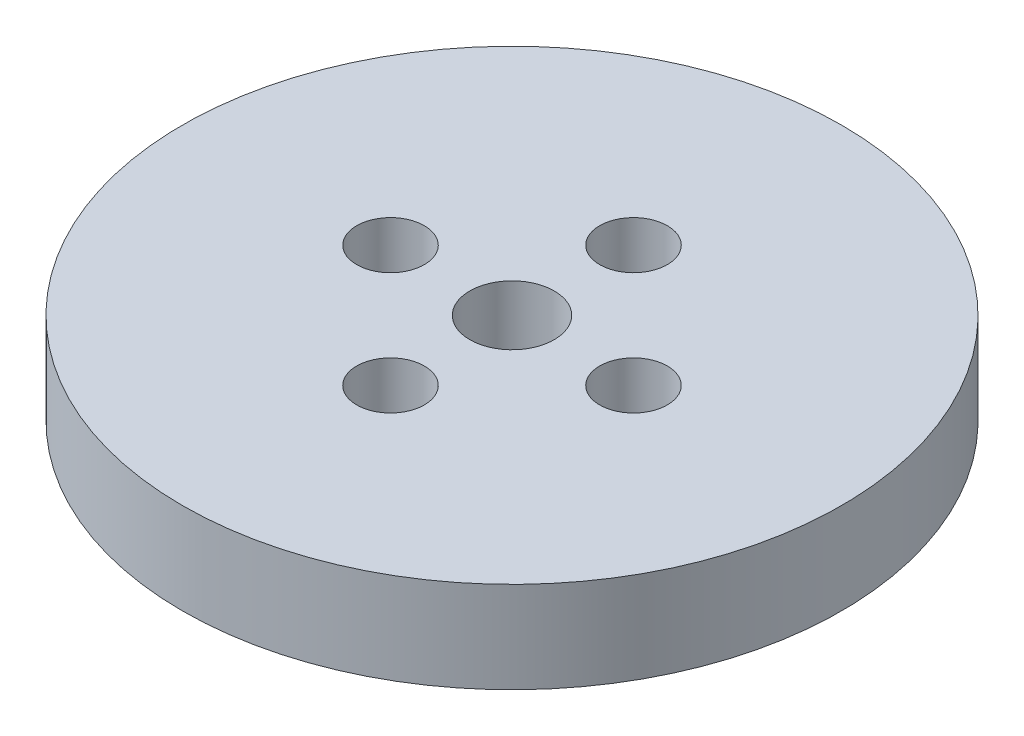
ISO-10303-21;
HEADER;
FILE_DESCRIPTION(('STEP AP214'),'2;1');
FILE_NAME('part.step','',(''),(''),'','','');
FILE_SCHEMA(('AUTOMOTIVE_DESIGN { 1 0 10303 214 1 1 1 1 }'));
ENDSEC;
DATA;
#1=APPLICATION_CONTEXT('core data for automotive mechanical design processes');
#2=APPLICATION_PROTOCOL_DEFINITION('international standard','automotive_design',2000,#1);
#3=PRODUCT_CONTEXT('',#1,'mechanical');
#4=PRODUCT('Part','Part','',(#3));
#5=PRODUCT_RELATED_PRODUCT_CATEGORY('part','',(#4));
#6=PRODUCT_DEFINITION_FORMATION('','',#4);
#7=PRODUCT_DEFINITION_CONTEXT('part definition',#1,'design');
#8=PRODUCT_DEFINITION('design','',#6,#7);
#9=PRODUCT_DEFINITION_SHAPE('','',#8);
#10=(LENGTH_UNIT() NAMED_UNIT(*) SI_UNIT(.MILLI.,.METRE.));
#11=(NAMED_UNIT(*) PLANE_ANGLE_UNIT() SI_UNIT($,.RADIAN.));
#12=(NAMED_UNIT(*) SI_UNIT($,.STERADIAN.) SOLID_ANGLE_UNIT());
#13=UNCERTAINTY_MEASURE_WITH_UNIT(LENGTH_MEASURE(1.E-05),#10,'distance_accuracy_value','');
#14=(GEOMETRIC_REPRESENTATION_CONTEXT(3) GLOBAL_UNCERTAINTY_ASSIGNED_CONTEXT((#13)) GLOBAL_UNIT_ASSIGNED_CONTEXT((#10,
#11,#12)) REPRESENTATION_CONTEXT('',''));
#15=CARTESIAN_POINT('',(0.,0.,0.));
#16=DIRECTION('',(0.,0.,1.));
#17=DIRECTION('',(1.,0.,0.));
#18=AXIS2_PLACEMENT_3D('',#15,#16,#17);
#19=CARTESIAN_POINT('',(0.,27.,0.));
#20=DIRECTION('',(0.,-1.,0.));
#21=DIRECTION('',(0.,0.,-1.));
#22=AXIS2_PLACEMENT_3D('',#19,#20,#21);
#23=CYLINDRICAL_SURFACE('',#22,97.5);
#24=CARTESIAN_POINT('',(0.,27.,0.));
#25=DIRECTION('',(0.,1.,0.));
#26=DIRECTION('',(0.,0.,1.));
#27=AXIS2_PLACEMENT_3D('',#24,#25,#26);
#28=CIRCLE('',#27,97.5);
#29=CARTESIAN_POINT('',(0.,27.,97.5));
#30=VERTEX_POINT('',#29);
#31=EDGE_CURVE('E10',#30,#30,#28,.T.);
#32=ORIENTED_EDGE('',*,*,#31,.F.);
#33=EDGE_LOOP('',(#32));
#34=FACE_BOUND('',#33,.T.);
#35=CARTESIAN_POINT('',(0.,0.,0.));
#36=DIRECTION('',(0.,1.,0.));
#37=DIRECTION('',(0.,0.,1.));
#38=AXIS2_PLACEMENT_3D('',#35,#36,#37);
#39=CIRCLE('',#38,97.5);
#40=CARTESIAN_POINT('',(0.,0.,97.5));
#41=VERTEX_POINT('',#40);
#42=EDGE_CURVE('E37',#41,#41,#39,.T.);
#43=ORIENTED_EDGE('',*,*,#42,.T.);
#44=EDGE_LOOP('',(#43));
#45=FACE_BOUND('',#44,.T.);
#46=ADVANCED_FACE('F40',(#34,#45),#23,.T.);
#47=CARTESIAN_POINT('',(0.,27.,0.));
#48=DIRECTION('',(0.,1.,0.));
#49=DIRECTION('',(0.,0.,1.));
#50=AXIS2_PLACEMENT_3D('',#47,#48,#49);
#51=PLANE('',#50);
#52=CARTESIAN_POINT('',(1.25500280436656E-13,27.,35.9447089235309));
#53=DIRECTION('',(0.,1.,0.));
#54=DIRECTION('',(1.,0.,0.));
#55=AXIS2_PLACEMENT_3D('',#52,#53,#54);
#56=CIRCLE('',#55,10.);
#57=CARTESIAN_POINT('',(10.0000000000001,27.,35.9447089235308));
#58=VERTEX_POINT('',#57);
#59=EDGE_CURVE('E71',#58,#58,#56,.T.);
#60=ORIENTED_EDGE('',*,*,#59,.F.);
#61=EDGE_LOOP('',(#60));
#62=FACE_BOUND('',#61,.T.);
#63=CARTESIAN_POINT('',(35.9447089235309,27.,0.));
#64=DIRECTION('',(0.,1.,0.));
#65=DIRECTION('',(0.,0.,-1.));
#66=AXIS2_PLACEMENT_3D('',#63,#64,#65);
#67=CIRCLE('',#66,10.);
#68=CARTESIAN_POINT('',(35.9447089235309,27.,-10.));
#69=VERTEX_POINT('',#68);
#70=EDGE_CURVE('E70',#69,#69,#67,.T.);
#71=ORIENTED_EDGE('',*,*,#70,.F.);
#72=EDGE_LOOP('',(#71));
#73=FACE_BOUND('',#72,.T.);
#74=CARTESIAN_POINT('',(-3.76500841309969E-13,27.,-35.9447089235309));
#75=DIRECTION('',(0.,1.,0.));
#76=DIRECTION('',(-1.,0.,0.));
#77=AXIS2_PLACEMENT_3D('',#74,#75,#76);
#78=CIRCLE('',#77,10.);
#79=CARTESIAN_POINT('',(-10.0000000000004,27.,-35.9447089235308));
#80=VERTEX_POINT('',#79);
#81=EDGE_CURVE('E61',#80,#80,#78,.T.);
#82=ORIENTED_EDGE('',*,*,#81,.F.);
#83=EDGE_LOOP('',(#82));
#84=FACE_BOUND('',#83,.T.);
#85=CARTESIAN_POINT('',(-35.9447089235309,27.,0.));
#86=DIRECTION('',(0.,1.,0.));
#87=DIRECTION('',(0.,0.,1.));
#88=AXIS2_PLACEMENT_3D('',#85,#86,#87);
#89=CIRCLE('',#88,10.);
#90=CARTESIAN_POINT('',(-35.9447089235309,27.,10.));
#91=VERTEX_POINT('',#90);
#92=EDGE_CURVE('E54',#91,#91,#89,.T.);
#93=ORIENTED_EDGE('',*,*,#92,.F.);
#94=EDGE_LOOP('',(#93));
#95=FACE_BOUND('',#94,.T.);
#96=CARTESIAN_POINT('',(0.,27.,0.));
#97=DIRECTION('',(0.,1.,0.));
#98=DIRECTION('',(0.,0.,1.));
#99=AXIS2_PLACEMENT_3D('',#96,#97,#98);
#100=CIRCLE('',#99,12.5);
#101=CARTESIAN_POINT('',(0.,27.,12.5));
#102=VERTEX_POINT('',#101);
#103=EDGE_CURVE('E50',#102,#102,#100,.T.);
#104=ORIENTED_EDGE('',*,*,#103,.F.);
#105=EDGE_LOOP('',(#104));
#106=FACE_BOUND('',#105,.T.);
#107=ORIENTED_EDGE('',*,*,#31,.T.);
#108=EDGE_LOOP('',(#107));
#109=FACE_BOUND('',#108,.T.);
#110=ADVANCED_FACE('F86',(#62,#73,#84,#95,#106,#109),#51,.T.);
#111=CARTESIAN_POINT('',(0.,0.,0.));
#112=DIRECTION('',(0.,1.,0.));
#113=DIRECTION('',(0.,0.,1.));
#114=AXIS2_PLACEMENT_3D('',#111,#112,#113);
#115=PLANE('',#114);
#116=CARTESIAN_POINT('',(0.,0.,0.));
#117=DIRECTION('',(0.,1.,0.));
#118=DIRECTION('',(0.,0.,1.));
#119=AXIS2_PLACEMENT_3D('',#116,#117,#118);
#120=CIRCLE('',#119,12.5);
#121=CARTESIAN_POINT('',(0.,0.,12.5));
#122=VERTEX_POINT('',#121);
#123=EDGE_CURVE('E47',#122,#122,#120,.T.);
#124=ORIENTED_EDGE('',*,*,#123,.T.);
#125=EDGE_LOOP('',(#124));
#126=FACE_BOUND('',#125,.T.);
#127=ORIENTED_EDGE('',*,*,#42,.F.);
#128=EDGE_LOOP('',(#127));
#129=FACE_BOUND('',#128,.T.);
#130=ADVANCED_FACE('F93',(#126,#129),#115,.F.);
#131=CARTESIAN_POINT('',(0.,27.,0.));
#132=DIRECTION('',(0.,-1.,0.));
#133=DIRECTION('',(0.,0.,-1.));
#134=AXIS2_PLACEMENT_3D('',#131,#132,#133);
#135=CYLINDRICAL_SURFACE('',#134,12.5);
#136=ORIENTED_EDGE('',*,*,#103,.T.);
#137=EDGE_LOOP('',(#136));
#138=FACE_BOUND('',#137,.T.);
#139=ORIENTED_EDGE('',*,*,#123,.F.);
#140=EDGE_LOOP('',(#139));
#141=FACE_BOUND('',#140,.T.);
#142=ADVANCED_FACE('F101',(#138,#141),#135,.F.);
#143=CARTESIAN_POINT('',(-35.9447089235309,8.21901846282417,0.));
#144=DIRECTION('',(0.,1.,0.));
#145=DIRECTION('',(0.,0.,1.));
#146=AXIS2_PLACEMENT_3D('',#143,#144,#145);
#147=CYLINDRICAL_SURFACE('',#146,10.);
#148=CARTESIAN_POINT('',(-35.9447089235309,8.21901846282417,0.));
#149=DIRECTION('',(0.,1.,0.));
#150=DIRECTION('',(0.,0.,1.));
#151=AXIS2_PLACEMENT_3D('',#148,#149,#150);
#152=CIRCLE('',#151,10.);
#153=CARTESIAN_POINT('',(-35.9447089235309,8.21901846282417,10.));
#154=VERTEX_POINT('',#153);
#155=EDGE_CURVE('E55',#154,#154,#152,.T.);
#156=ORIENTED_EDGE('',*,*,#155,.F.);
#157=EDGE_LOOP('',(#156));
#158=FACE_BOUND('',#157,.T.);
#159=ORIENTED_EDGE('',*,*,#92,.T.);
#160=EDGE_LOOP('',(#159));
#161=FACE_BOUND('',#160,.T.);
#162=ADVANCED_FACE('F102',(#158,#161),#147,.F.);
#163=CARTESIAN_POINT('',(-35.9447089235309,8.21901846282417,0.));
#164=DIRECTION('',(0.,1.,0.));
#165=DIRECTION('',(0.,0.,1.));
#166=AXIS2_PLACEMENT_3D('',#163,#164,#165);
#167=PLANE('',#166);
#168=ORIENTED_EDGE('',*,*,#155,.T.);
#169=EDGE_LOOP('',(#168));
#170=FACE_BOUND('',#169,.T.);
#171=ADVANCED_FACE('F133',(#170),#167,.T.);
#172=CARTESIAN_POINT('',(-3.76500841309969E-13,8.21901846282417,-35.9447089235309));
#173=DIRECTION('',(0.,1.,0.));
#174=DIRECTION('',(0.,0.,1.));
#175=AXIS2_PLACEMENT_3D('',#172,#173,#174);
#176=CYLINDRICAL_SURFACE('',#175,10.);
#177=CARTESIAN_POINT('',(-3.76500841309969E-13,8.21901846282417,-35.9447089235309));
#178=DIRECTION('',(0.,1.,0.));
#179=DIRECTION('',(-1.,0.,0.));
#180=AXIS2_PLACEMENT_3D('',#177,#178,#179);
#181=CIRCLE('',#180,10.);
#182=CARTESIAN_POINT('',(-10.0000000000004,8.21901846282417,-35.9447089235308));
#183=VERTEX_POINT('',#182);
#184=EDGE_CURVE('E63',#183,#183,#181,.T.);
#185=ORIENTED_EDGE('',*,*,#184,.F.);
#186=EDGE_LOOP('',(#185));
#187=FACE_BOUND('',#186,.T.);
#188=ORIENTED_EDGE('',*,*,#81,.T.);
#189=EDGE_LOOP('',(#188));
#190=FACE_BOUND('',#189,.T.);
#191=ADVANCED_FACE('F142',(#187,#190),#176,.F.);
#192=CARTESIAN_POINT('',(-3.76500841309969E-13,8.21901846282417,-35.9447089235309));
#193=DIRECTION('',(0.,1.,0.));
#194=DIRECTION('',(-1.,0.,0.));
#195=AXIS2_PLACEMENT_3D('',#192,#193,#194);
#196=PLANE('',#195);
#197=ORIENTED_EDGE('',*,*,#184,.T.);
#198=EDGE_LOOP('',(#197));
#199=FACE_BOUND('',#198,.T.);
#200=ADVANCED_FACE('F156',(#199),#196,.T.);
#201=CARTESIAN_POINT('',(35.9447089235309,8.21901846282417,0.));
#202=DIRECTION('',(0.,1.,0.));
#203=DIRECTION('',(0.,0.,1.));
#204=AXIS2_PLACEMENT_3D('',#201,#202,#203);
#205=CYLINDRICAL_SURFACE('',#204,10.);
#206=CARTESIAN_POINT('',(35.9447089235309,8.21901846282417,0.));
#207=DIRECTION('',(0.,1.,0.));
#208=DIRECTION('',(0.,0.,-1.));
#209=AXIS2_PLACEMENT_3D('',#206,#207,#208);
#210=CIRCLE('',#209,10.);
#211=CARTESIAN_POINT('',(35.9447089235309,8.21901846282417,-10.));
#212=VERTEX_POINT('',#211);
#213=EDGE_CURVE('E69',#212,#212,#210,.T.);
#214=ORIENTED_EDGE('',*,*,#213,.F.);
#215=EDGE_LOOP('',(#214));
#216=FACE_BOUND('',#215,.T.);
#217=ORIENTED_EDGE('',*,*,#70,.T.);
#218=EDGE_LOOP('',(#217));
#219=FACE_BOUND('',#218,.T.);
#220=ADVANCED_FACE('F164',(#216,#219),#205,.F.);
#221=CARTESIAN_POINT('',(35.9447089235309,8.21901846282417,0.));
#222=DIRECTION('',(0.,1.,0.));
#223=DIRECTION('',(0.,0.,-1.));
#224=AXIS2_PLACEMENT_3D('',#221,#222,#223);
#225=PLANE('',#224);
#226=ORIENTED_EDGE('',*,*,#213,.T.);
#227=EDGE_LOOP('',(#226));
#228=FACE_BOUND('',#227,.T.);
#229=ADVANCED_FACE('F83',(#228),#225,.T.);
#230=CARTESIAN_POINT('',(1.25500280436656E-13,8.21901846282417,35.9447089235309));
#231=DIRECTION('',(0.,1.,0.));
#232=DIRECTION('',(0.,0.,1.));
#233=AXIS2_PLACEMENT_3D('',#230,#231,#232);
#234=CYLINDRICAL_SURFACE('',#233,10.);
#235=CARTESIAN_POINT('',(1.25500280436656E-13,8.21901846282417,35.9447089235309));
#236=DIRECTION('',(0.,1.,0.));
#237=DIRECTION('',(1.,0.,0.));
#238=AXIS2_PLACEMENT_3D('',#235,#236,#237);
#239=CIRCLE('',#238,10.);
#240=CARTESIAN_POINT('',(10.0000000000001,8.21901846282417,35.9447089235308));
#241=VERTEX_POINT('',#240);
#242=EDGE_CURVE('E59',#241,#241,#239,.T.);
#243=ORIENTED_EDGE('',*,*,#242,.F.);
#244=EDGE_LOOP('',(#243));
#245=FACE_BOUND('',#244,.T.);
#246=ORIENTED_EDGE('',*,*,#59,.T.);
#247=EDGE_LOOP('',(#246));
#248=FACE_BOUND('',#247,.T.);
#249=ADVANCED_FACE('F81',(#245,#248),#234,.F.);
#250=CARTESIAN_POINT('',(1.25500280436656E-13,8.21901846282417,35.9447089235309));
#251=DIRECTION('',(0.,1.,0.));
#252=DIRECTION('',(1.,0.,0.));
#253=AXIS2_PLACEMENT_3D('',#250,#251,#252);
#254=PLANE('',#253);
#255=ORIENTED_EDGE('',*,*,#242,.T.);
#256=EDGE_LOOP('',(#255));
#257=FACE_BOUND('',#256,.T.);
#258=ADVANCED_FACE('F78',(#257),#254,.T.);
#259=CLOSED_SHELL('',(#46,#110,#130,#142,#162,#171,#191,#200,#220,#229,#249,#258));
#260=MANIFOLD_SOLID_BREP('B2',#259);
#261=ADVANCED_BREP_SHAPE_REPRESENTATION('',(#18,#260),#14);
#262=SHAPE_DEFINITION_REPRESENTATION(#9,#261);
ENDSEC;
END-ISO-10303-21;
